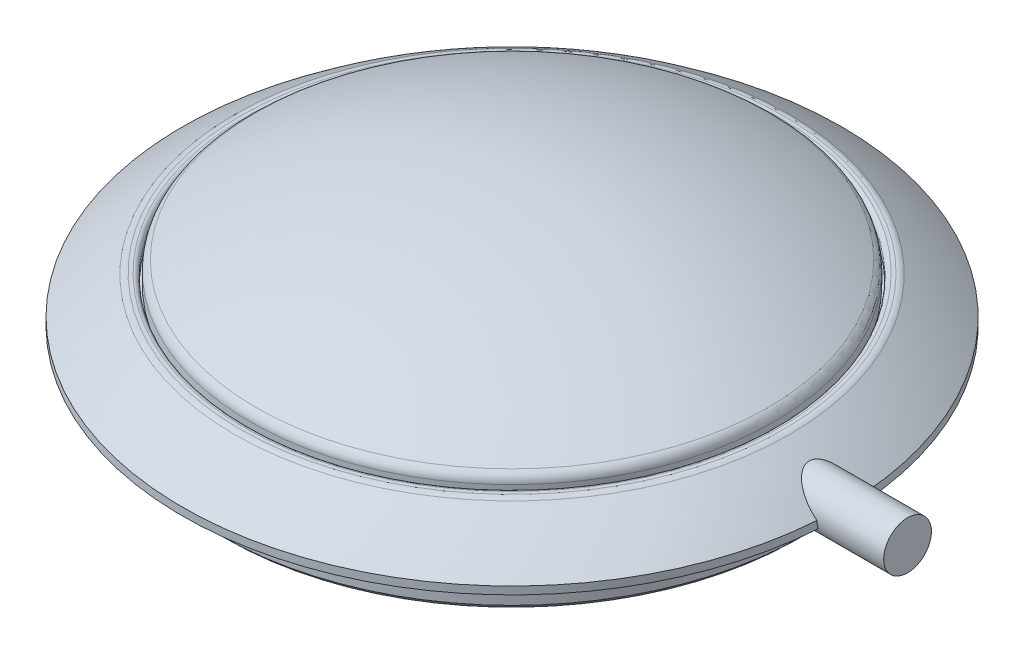
ISO-10303-21;
HEADER;
FILE_DESCRIPTION(('STEP AP214'),'2;1');
FILE_NAME('part.step','',(''),(''),'','','');
FILE_SCHEMA(('AUTOMOTIVE_DESIGN { 1 0 10303 214 1 1 1 1 }'));
ENDSEC;
DATA;
#1=APPLICATION_CONTEXT('core data for automotive mechanical design processes');
#2=APPLICATION_PROTOCOL_DEFINITION('international standard','automotive_design',2000,#1);
#3=PRODUCT_CONTEXT('',#1,'mechanical');
#4=PRODUCT('Part','Part','',(#3));
#5=PRODUCT_RELATED_PRODUCT_CATEGORY('part','',(#4));
#6=PRODUCT_DEFINITION_FORMATION('','',#4);
#7=PRODUCT_DEFINITION_CONTEXT('part definition',#1,'design');
#8=PRODUCT_DEFINITION('design','',#6,#7);
#9=PRODUCT_DEFINITION_SHAPE('','',#8);
#10=(LENGTH_UNIT() NAMED_UNIT(*) SI_UNIT(.MILLI.,.METRE.));
#11=(NAMED_UNIT(*) PLANE_ANGLE_UNIT() SI_UNIT($,.RADIAN.));
#12=(NAMED_UNIT(*) SI_UNIT($,.STERADIAN.) SOLID_ANGLE_UNIT());
#13=UNCERTAINTY_MEASURE_WITH_UNIT(LENGTH_MEASURE(1.E-05),#10,'distance_accuracy_value','');
#14=(GEOMETRIC_REPRESENTATION_CONTEXT(3) GLOBAL_UNCERTAINTY_ASSIGNED_CONTEXT((#13)) GLOBAL_UNIT_ASSIGNED_CONTEXT((#10,
#11,#12)) REPRESENTATION_CONTEXT('',''));
#15=CARTESIAN_POINT('',(0.,0.,0.));
#16=DIRECTION('',(0.,0.,1.));
#17=DIRECTION('',(1.,0.,0.));
#18=AXIS2_PLACEMENT_3D('',#15,#16,#17);
#19=CARTESIAN_POINT('',(0.,15.,0.));
#20=DIRECTION('',(0.,-1.,0.));
#21=DIRECTION('',(0.,0.,-1.));
#22=AXIS2_PLACEMENT_3D('',#19,#20,#21);
#23=CYLINDRICAL_SURFACE('',#22,30.);
#24=CARTESIAN_POINT('',(29.9210523711984,4.5,2.175));
#25=CARTESIAN_POINT('',(29.9210507722902,4.44040425495209,2.17500557248523));
#26=CARTESIAN_POINT('',(29.9212304240732,4.38080951030615,2.17255060085139));
#27=CARTESIAN_POINT('',(29.9219378031227,4.26242174033899,2.16279440265997));
#28=CARTESIAN_POINT('',(29.9224631930128,4.20362601873529,2.15552571732212));
#29=CARTESIAN_POINT('',(29.9238479367281,4.08682776167588,2.13621567310057));
#30=CARTESIAN_POINT('',(29.9247072901133,4.02882522517506,2.12417432050601));
#31=CARTESIAN_POINT('',(29.9267416387054,3.91361186554651,2.09531154058866));
#32=CARTESIAN_POINT('',(29.9279187214244,3.8564090089525,2.07845845586816));
#33=CARTESIAN_POINT('',(29.9292394657799,3.8,2.05927778602111));
#34=B_SPLINE_CURVE_WITH_KNOTS('',3,(#24,#25,#26,#27,#28,#29,#30,#31,#32,#33),.UNSPECIFIED.,.F.,
.F.,(4,2,2,2,4),(0.,0.178734835087422,0.356273571488974,0.533812073941133,0.712546674705668),.UNSPECIFIED.);
#35=CARTESIAN_POINT('',(29.9210523711984,4.5,2.175));
#36=VERTEX_POINT('',#35);
#37=CARTESIAN_POINT('',(29.92923946578,3.8,2.05927778602111));
#38=VERTEX_POINT('',#37);
#39=EDGE_CURVE('E114',#36,#38,#34,.T.);
#40=ORIENTED_EDGE('',*,*,#39,.F.);
#41=CARTESIAN_POINT('',(0.,4.5,0.));
#42=DIRECTION('',(0.,-1.,0.));
#43=DIRECTION('',(0.,0.,-1.));
#44=AXIS2_PLACEMENT_3D('',#41,#42,#43);
#45=CIRCLE('',#44,30.);
#46=CARTESIAN_POINT('',(29.9210523711984,4.5,-2.175));
#47=VERTEX_POINT('',#46);
#48=EDGE_CURVE('E124',#36,#47,#45,.T.);
#49=ORIENTED_EDGE('',*,*,#48,.T.);
#50=CARTESIAN_POINT('',(29.92923946578,3.8,-2.05927778602111));
#51=CARTESIAN_POINT('',(29.9279187214244,3.85640900895251,-2.07845845586816));
#52=CARTESIAN_POINT('',(29.9267416387054,3.91361186554651,-2.09531154058866));
#53=CARTESIAN_POINT('',(29.9247072901133,4.02882522517506,-2.12417432050601));
#54=CARTESIAN_POINT('',(29.9238479367281,4.08682776167588,-2.13621567310057));
#55=CARTESIAN_POINT('',(29.9224631930128,4.20362601873529,-2.15552571732212));
#56=CARTESIAN_POINT('',(29.9219378031227,4.26242174033899,-2.16279440265997));
#57=CARTESIAN_POINT('',(29.9212304240732,4.38080951030615,-2.17255060085139));
#58=CARTESIAN_POINT('',(29.9210507722902,4.44040425495209,-2.17500557248523));
#59=CARTESIAN_POINT('',(29.9210523711984,4.5,-2.175));
#60=B_SPLINE_CURVE_WITH_KNOTS('',3,(#50,#51,#52,#53,#54,#55,#56,#57,#58,#59),.UNSPECIFIED.,.F.,
.F.,(4,2,2,2,4),(0.,0.178734600764535,0.356273103216694,0.533811839618246,0.712546674705668),.UNSPECIFIED.);
#61=CARTESIAN_POINT('',(29.92923946578,3.8,-2.05927778602111));
#62=VERTEX_POINT('',#61);
#63=EDGE_CURVE('E82',#62,#47,#60,.T.);
#64=ORIENTED_EDGE('',*,*,#63,.F.);
#65=CARTESIAN_POINT('',(0.,3.8,0.));
#66=DIRECTION('',(0.,1.,0.));
#67=DIRECTION('',(0.,0.,1.));
#68=AXIS2_PLACEMENT_3D('',#65,#66,#67);
#69=CIRCLE('',#68,30.);
#70=EDGE_CURVE('E120',#62,#38,#69,.T.);
#71=ORIENTED_EDGE('',*,*,#70,.T.);
#72=EDGE_LOOP('',(#40,#49,#64,#71));
#73=FACE_BOUND('',#72,.T.);
#74=ADVANCED_FACE('F67',(#73),#23,.T.);
#75=CARTESIAN_POINT('',(0.,3.8,0.));
#76=DIRECTION('',(0.,1.,0.));
#77=DIRECTION('',(0.,0.,1.));
#78=AXIS2_PLACEMENT_3D('',#75,#76,#77);
#79=PLANE('',#78);
#80=DIRECTION('',(-1.,0.,0.));
#81=VECTOR('',#80,1.);
#82=CARTESIAN_POINT('',(36.,3.8,-2.05927778602111));
#83=LINE('',#82,#81);
#84=CARTESIAN_POINT('',(27.4227893366083,3.8,-2.05927778602111));
#85=VERTEX_POINT('',#84);
#86=EDGE_CURVE('E299',#85,#62,#83,.F.);
#87=ORIENTED_EDGE('',*,*,#86,.F.);
#88=CARTESIAN_POINT('',(0.,3.8,0.));
#89=DIRECTION('',(0.,1.,0.));
#90=DIRECTION('',(0.,0.,1.));
#91=AXIS2_PLACEMENT_3D('',#88,#89,#90);
#92=CIRCLE('',#91,27.5);
#93=CARTESIAN_POINT('',(27.4227893366083,3.8,2.05927778602111));
#94=VERTEX_POINT('',#93);
#95=EDGE_CURVE('E140',#85,#94,#92,.T.);
#96=ORIENTED_EDGE('',*,*,#95,.T.);
#97=DIRECTION('',(-1.,0.,0.));
#98=VECTOR('',#97,1.);
#99=CARTESIAN_POINT('',(36.,3.8,2.05927778602111));
#100=LINE('',#99,#98);
#101=EDGE_CURVE('E126',#38,#94,#100,.T.);
#102=ORIENTED_EDGE('',*,*,#101,.F.);
#103=ORIENTED_EDGE('',*,*,#70,.F.);
#104=EDGE_LOOP('',(#87,#96,#102,#103));
#105=FACE_BOUND('',#104,.T.);
#106=ADVANCED_FACE('F197',(#105),#79,.F.);
#107=CARTESIAN_POINT('',(0.,3.8,0.));
#108=DIRECTION('',(0.,-1.,0.));
#109=DIRECTION('',(0.,0.,-1.));
#110=AXIS2_PLACEMENT_3D('',#107,#108,#109);
#111=CYLINDRICAL_SURFACE('',#110,27.5);
#112=CARTESIAN_POINT('',(27.4227893366083,3.8,2.05927778602111));
#113=CARTESIAN_POINT('',(27.4239161252362,3.75583828138245,2.04426828444051));
#114=CARTESIAN_POINT('',(27.4251380844221,3.7121633113989,2.02783521702575));
#115=CARTESIAN_POINT('',(27.4277445556678,3.62614056304129,1.99227249811847));
#116=CARTESIAN_POINT('',(27.4291283794124,3.58378807001969,1.97315420030913));
#117=CARTESIAN_POINT('',(27.4320404166582,3.50039835059532,1.93224697358378));
#118=CARTESIAN_POINT('',(27.4335686299862,3.45936112261433,1.91045804787252));
#119=CARTESIAN_POINT('',(27.4367503508111,3.37860161561401,1.86420682910092));
#120=CARTESIAN_POINT('',(27.438404349089,3.33888545824047,1.83973388034803));
#121=CARTESIAN_POINT('',(27.4401052293901,3.3,1.81400799336717));
#122=B_SPLINE_CURVE_WITH_KNOTS('',3,(#112,#113,#114,#115,#116,#117,#118,#119,#120,#121),
.UNSPECIFIED.,.F.,.F.,(4,2,2,2,4),(0.,0.139944074089579,0.279313317385029,0.418682393439945,
0.558626300112478),.UNSPECIFIED.);
#123=CARTESIAN_POINT('',(27.4401052293901,3.3,1.81400799336717));
#124=VERTEX_POINT('',#123);
#125=EDGE_CURVE('E184',#94,#124,#122,.T.);
#126=ORIENTED_EDGE('',*,*,#125,.F.);
#127=ORIENTED_EDGE('',*,*,#95,.F.);
#128=CARTESIAN_POINT('',(27.4401052293901,3.3,-1.81400799336717));
#129=CARTESIAN_POINT('',(27.438404349089,3.33888545824047,-1.83973388034803));
#130=CARTESIAN_POINT('',(27.4367503508111,3.37860161561401,-1.86420682910092));
#131=CARTESIAN_POINT('',(27.4335686299862,3.45936112261433,-1.91045804787252));
#132=CARTESIAN_POINT('',(27.4320404166582,3.50039835059532,-1.93224697358378));
#133=CARTESIAN_POINT('',(27.4291283794124,3.58378807001969,-1.97315420030913));
#134=CARTESIAN_POINT('',(27.4277445556678,3.62614056304129,-1.99227249811847));
#135=CARTESIAN_POINT('',(27.4251380844221,3.7121633113989,-2.02783521702575));
#136=CARTESIAN_POINT('',(27.4239161252362,3.75583828138245,-2.04426828444051));
#137=CARTESIAN_POINT('',(27.4227893366083,3.8,-2.05927778602111));
#138=B_SPLINE_CURVE_WITH_KNOTS('',3,(#128,#129,#130,#131,#132,#133,#134,#135,#136,#137),
.UNSPECIFIED.,.F.,.F.,(4,2,2,2,4),(0.,0.139943906672533,0.279312982727449,0.4186822260229,
0.558626300112478),.UNSPECIFIED.);
#139=CARTESIAN_POINT('',(27.4401052293901,3.3,-1.81400799336717));
#140=VERTEX_POINT('',#139);
#141=EDGE_CURVE('E177',#140,#85,#138,.T.);
#142=ORIENTED_EDGE('',*,*,#141,.F.);
#143=CARTESIAN_POINT('',(0.,3.3,0.));
#144=DIRECTION('',(0.,1.,0.));
#145=DIRECTION('',(0.,0.,1.));
#146=AXIS2_PLACEMENT_3D('',#143,#144,#145);
#147=CIRCLE('',#146,27.5);
#148=EDGE_CURVE('E133',#140,#124,#147,.T.);
#149=ORIENTED_EDGE('',*,*,#148,.T.);
#150=EDGE_LOOP('',(#126,#127,#142,#149));
#151=FACE_BOUND('',#150,.T.);
#152=ADVANCED_FACE('F191',(#151),#111,.T.);
#153=CARTESIAN_POINT('',(0.,3.3,0.));
#154=DIRECTION('',(0.,1.,0.));
#155=DIRECTION('',(0.,0.,1.));
#156=AXIS2_PLACEMENT_3D('',#153,#154,#155);
#157=PLANE('',#156);
#158=DIRECTION('',(-1.,0.,0.));
#159=VECTOR('',#158,1.);
#160=CARTESIAN_POINT('',(36.,3.3,-1.81400799336717));
#161=LINE('',#160,#159);
#162=CARTESIAN_POINT('',(26.4378398323312,3.3,-1.81400799336717));
#163=VERTEX_POINT('',#162);
#164=EDGE_CURVE('E265',#163,#140,#161,.F.);
#165=ORIENTED_EDGE('',*,*,#164,.F.);
#166=CARTESIAN_POINT('',(0.,3.3,0.));
#167=DIRECTION('',(0.,1.,0.));
#168=DIRECTION('',(0.,0.,1.));
#169=AXIS2_PLACEMENT_3D('',#166,#167,#168);
#170=CIRCLE('',#169,26.5);
#171=CARTESIAN_POINT('',(26.4378398323312,3.3,1.81400799336717));
#172=VERTEX_POINT('',#171);
#173=EDGE_CURVE('E129',#163,#172,#170,.T.);
#174=ORIENTED_EDGE('',*,*,#173,.T.);
#175=DIRECTION('',(-1.,0.,0.));
#176=VECTOR('',#175,1.);
#177=CARTESIAN_POINT('',(36.,3.3,1.81400799336717));
#178=LINE('',#177,#176);
#179=EDGE_CURVE('E189',#124,#172,#178,.T.);
#180=ORIENTED_EDGE('',*,*,#179,.F.);
#181=ORIENTED_EDGE('',*,*,#148,.F.);
#182=EDGE_LOOP('',(#165,#174,#180,#181));
#183=FACE_BOUND('',#182,.T.);
#184=ADVANCED_FACE('F196',(#183),#157,.F.);
#185=CARTESIAN_POINT('',(0.,3.3,0.));
#186=DIRECTION('',(0.,-1.,0.));
#187=DIRECTION('',(0.,0.,-1.));
#188=AXIS2_PLACEMENT_3D('',#185,#186,#187);
#189=CYLINDRICAL_SURFACE('',#188,26.5);
#190=CARTESIAN_POINT('',(0.,0.500000000000007,0.));
#191=DIRECTION('',(0.,1.,0.));
#192=DIRECTION('',(0.,0.,1.));
#193=AXIS2_PLACEMENT_3D('',#190,#191,#192);
#194=CIRCLE('',#193,26.5);
#195=CARTESIAN_POINT('',(0.,0.500000000000007,26.5));
#196=VERTEX_POINT('',#195);
#197=EDGE_CURVE('E119',#196,#196,#194,.T.);
#198=ORIENTED_EDGE('',*,*,#197,.T.);
#199=EDGE_LOOP('',(#198));
#200=FACE_BOUND('',#199,.T.);
#201=CARTESIAN_POINT('',(26.4378398323312,3.3,1.81400799336717));
#202=CARTESIAN_POINT('',(26.4401571000158,3.24893763478484,1.78022867010242));
#203=CARTESIAN_POINT('',(26.4425569249394,3.19932910952958,1.7443108591682));
#204=CARTESIAN_POINT('',(26.4474535463998,3.10331891973786,1.66842885337983));
#205=CARTESIAN_POINT('',(26.4499503382451,3.05691710035103,1.62846485414437));
#206=CARTESIAN_POINT('',(26.4574768798844,2.92309536870965,1.50296813598129));
#207=CARTESIAN_POINT('',(26.4625500565354,2.8409063216402,1.4117293547589));
#208=CARTESIAN_POINT('',(26.4722324935605,2.69301467521226,1.21672957903897));
#209=CARTESIAN_POINT('',(26.4768415338913,2.62731987380775,1.11296269585466));
#210=CARTESIAN_POINT('',(26.4850757309654,2.51428923108145,0.895847824353795));
#211=CARTESIAN_POINT('',(26.4887011305246,2.46694885764793,0.782502209666496));
#212=CARTESIAN_POINT('',(26.4945562281915,2.39202949149202,0.549578756972597));
#213=CARTESIAN_POINT('',(26.4967876160912,2.36442656754835,0.430008655469356));
#214=CARTESIAN_POINT('',(26.4996104079275,2.32968171042448,0.187888162837732));
#215=CARTESIAN_POINT('',(26.5002015168659,2.32254345773444,0.0653372396166261));
#216=CARTESIAN_POINT('',(26.4996769010041,2.32893813744245,-0.178861701445099));
#217=CARTESIAN_POINT('',(26.4985661328941,2.3424110399991,-0.300511308387864));
#218=CARTESIAN_POINT('',(26.4947719409747,2.38952379965176,-0.53979803196447));
#219=CARTESIAN_POINT('',(26.4920887328104,2.423160891436,-0.657435696457509));
#220=CARTESIAN_POINT('',(26.4854499578581,2.50964035329496,-0.885416949579747));
#221=CARTESIAN_POINT('',(26.481494046685,2.5624879221013,-0.995758554189695));
#222=CARTESIAN_POINT('',(26.47275164673,2.68589417514891,-1.20602779146514));
#223=CARTESIAN_POINT('',(26.4679651828547,2.75645232831403,-1.30595573627137));
#224=CARTESIAN_POINT('',(26.4588124214033,2.90192769555066,-1.47907328627082));
#225=CARTESIAN_POINT('',(26.4544851686266,2.97474647693113,-1.55404046621584));
#226=CARTESIAN_POINT('',(26.4459705897753,3.1303063045741,-1.69277036127136));
#227=CARTESIAN_POINT('',(26.4417831898548,3.21304200504405,-1.75653906770989));
#228=CARTESIAN_POINT('',(26.4378398323312,3.3,-1.81400799336717));
#229=B_SPLINE_CURVE_WITH_KNOTS('',3,(#201,#202,#203,#204,#205,#206,#207,#208,#209,#210,#211,
#212,#213,#214,#215,#216,#217,#218,#219,#220,#221,#222,#223,#224,#225,#226,#227,#228),
.UNSPECIFIED.,.F.,.F.,(4,2,2,2,2,2,2,2,2,2,2,2,2,4),(0.,0.183691053921572,0.367373231277329,
0.734193948532478,1.10118776176677,1.46809089836099,1.8345484151854,2.20107183381117,
2.56652978610665,2.9319376310537,3.29744443623354,3.66294028249987,3.97569177008202,
4.28827541839682),.UNSPECIFIED.);
#230=EDGE_CURVE('E261',#172,#163,#229,.T.);
#231=ORIENTED_EDGE('',*,*,#230,.F.);
#232=ORIENTED_EDGE('',*,*,#173,.F.);
#233=EDGE_LOOP('',(#231,#232));
#234=FACE_BOUND('',#233,.T.);
#235=ADVANCED_FACE('F257',(#200,#234),#189,.T.);
#236=CARTESIAN_POINT('',(0.,-33.107142857143,0.));
#237=DIRECTION('',(0.,-1.,0.));
#238=DIRECTION('',(-1.,0.,0.));
#239=AXIS2_PLACEMENT_3D('',#236,#237,#238);
#240=SPHERICAL_SURFACE('',#239,48.107142857143);
#241=CARTESIAN_POINT('',(0.,7.84519134720959,0.));
#242=DIRECTION('',(0.,-1.,0.));
#243=DIRECTION('',(0.,0.,-1.));
#244=AXIS2_PLACEMENT_3D('',#241,#242,#243);
#245=CIRCLE('',#244,25.2428904266642);
#246=CARTESIAN_POINT('',(0.,7.84519134720959,-25.2428904266642));
#247=VERTEX_POINT('',#246);
#248=EDGE_CURVE('E232',#247,#247,#245,.T.);
#249=ORIENTED_EDGE('',*,*,#248,.T.);
#250=EDGE_LOOP('',(#249));
#251=FACE_BOUND('',#250,.T.);
#252=ORIENTED_EDGE('',*,*,#48,.F.);
#253=CARTESIAN_POINT('',(29.9213037459457,4.4998,2.1749999908046));
#254=CARTESIAN_POINT('',(29.860354409551,4.54829320853694,2.17500101073915));
#255=CARTESIAN_POINT('',(29.7993402127421,4.59668941116069,2.17338739780968));
#256=CARTESIAN_POINT('',(29.6772704406083,4.69321751794534,2.16694138842662));
#257=CARTESIAN_POINT('',(29.6162148643579,4.74134941595931,2.16210891742911));
#258=CARTESIAN_POINT('',(29.4328962224406,4.88541794087907,2.14277515477485));
#259=CARTESIAN_POINT('',(29.3107082196935,4.98084680733808,2.12343756567662));
#260=CARTESIAN_POINT('',(29.0661264076119,5.17068098470287,2.0713788812293));
#261=CARTESIAN_POINT('',(28.9437457301755,5.26506272433349,2.03850975642602));
#262=CARTESIAN_POINT('',(28.7014353048051,5.45077224635833,1.95879062723407));
#263=CARTESIAN_POINT('',(28.5815031137465,5.542103137305,1.91195536829822));
#264=CARTESIAN_POINT('',(28.3370549396025,5.727115456864,1.79927139599704));
#265=CARTESIAN_POINT('',(28.2128153882553,5.82050567619035,1.73231151079199));
#266=CARTESIAN_POINT('',(28.0321707853541,5.95544717066019,1.61733367964668));
#267=CARTESIAN_POINT('',(27.9729615452683,5.99953119066519,1.57662996796225));
#268=CARTESIAN_POINT('',(27.8569418112767,6.08564994744236,1.48998988873699));
#269=CARTESIAN_POINT('',(27.8001306972233,6.12768521445557,1.44405488549472));
#270=CARTESIAN_POINT('',(27.6632603497254,6.2286614233344,1.32332012683041));
#271=CARTESIAN_POINT('',(27.5849967277748,6.28613301775396,1.24518354635422));
#272=CARTESIAN_POINT('',(27.4385223242699,6.39328669582687,1.0752411284962));
#273=CARTESIAN_POINT('',(27.3702943623947,6.44298210128511,0.983459205763183));
#274=CARTESIAN_POINT('',(27.2673376366543,6.51774811614942,0.815484517155771));
#275=CARTESIAN_POINT('',(27.2287217128449,6.54571814374497,0.742990335232145));
#276=CARTESIAN_POINT('',(27.1611674942129,6.59456881189191,0.591372431429883));
#277=CARTESIAN_POINT('',(27.1322157650086,6.61545929447521,0.512258105429106));
#278=CARTESIAN_POINT('',(27.0897889753825,6.64604305897315,0.360809830208454));
#279=CARTESIAN_POINT('',(27.0746660712701,6.65692973928714,0.289184948652009));
#280=CARTESIAN_POINT('',(27.0544671981202,6.67146629247286,0.143813675632987));
#281=CARTESIAN_POINT('',(27.0493845589975,6.67512096980992,0.0700687256674828));
#282=CARTESIAN_POINT('',(27.0497296583231,6.67487274938097,-0.0774611809869981));
#283=CARTESIAN_POINT('',(27.0551684190373,6.67096192596236,-0.15124609858896));
#284=CARTESIAN_POINT('',(27.0760681139207,6.65592042989793,-0.29662564397149));
#285=CARTESIAN_POINT('',(27.0915361271205,6.64478465760272,-0.368218687235695));
#286=CARTESIAN_POINT('',(27.1357864882382,6.61288390579251,-0.523420023785068));
#287=CARTESIAN_POINT('',(27.1667979186022,6.59050416392385,-0.606054308969611));
#288=CARTESIAN_POINT('',(27.2392257070044,6.53811373993336,-0.763987410128501));
#289=CARTESIAN_POINT('',(27.2806597193854,6.50809010911517,-0.839273475881303));
#290=CARTESIAN_POINT('',(27.3922098293659,6.42703498156613,-1.01507599068411));
#291=CARTESIAN_POINT('',(27.466744703681,6.37269815550825,-1.11123275329663));
#292=CARTESIAN_POINT('',(27.6265352853494,6.25565512219816,-1.28825732774018));
#293=CARTESIAN_POINT('',(27.7118140692596,6.19293088148876,-1.36909126298254));
#294=CARTESIAN_POINT('',(27.8723596261126,6.07425039683469,-1.50291022502454));
#295=CARTESIAN_POINT('',(27.9464259715694,6.01929097810602,-1.55826526644343));
#296=CARTESIAN_POINT('',(28.0979107869339,5.90641530980611,-1.66085615470386));
#297=CARTESIAN_POINT('',(28.1753312747706,5.84849727640427,-1.70808702649916));
#298=CARTESIAN_POINT('',(28.3327910443669,5.7301990999166,-1.79517217474891));
#299=CARTESIAN_POINT('',(28.4128372182507,5.66981235403557,-1.83500484247064));
#300=CARTESIAN_POINT('',(28.5746860883655,5.54718461812118,-1.90764454341597));
#301=CARTESIAN_POINT('',(28.6564891569834,5.48494323387845,-1.94045007068796));
#302=CARTESIAN_POINT('',(28.8361666153164,5.34763583099867,-2.00471293971274));
#303=CARTESIAN_POINT('',(28.9342842350005,5.27227741770302,-2.03486550743554));
#304=CARTESIAN_POINT('',(29.1316038502371,5.11994574122822,-2.08632542194493));
#305=CARTESIAN_POINT('',(29.2308061318557,5.04297204686567,-2.10763037456576));
#306=CARTESIAN_POINT('',(29.4285941388551,4.8887144018224,-2.14142375886964));
#307=CARTESIAN_POINT('',(29.5271738141543,4.81144422506462,-2.15401086777727));
#308=CARTESIAN_POINT('',(29.7243346386744,4.65612816160523,-2.17078694338801));
#309=CARTESIAN_POINT('',(29.8229157463872,4.57808280428474,-2.17498129198194));
#310=CARTESIAN_POINT('',(29.9213037459457,4.4998,-2.1749999908046));
#311=B_SPLINE_CURVE_WITH_KNOTS('',3,(#253,#254,#255,#256,#257,#258,#259,#260,#261,#262,#263,
#264,#265,#266,#267,#268,#269,#270,#271,#272,#273,#274,#275,#276,#277,#278,#279,#280,#281,#282,
#283,#284,#285,#286,#287,#288,#289,#290,#291,#292,#293,#294,#295,#296,#297,#298,#299,#300,#301,
#302,#303,#304,#305,#306,#307,#308,#309,#310),.UNSPECIFIED.,.F.,.F.,(4,2,2,2,2,2,2,2,2,2,2,2,2,
2,2,2,2,2,2,2,2,2,2,2,2,2,2,2,4),(0.,0.233625579629342,0.467256569863057,0.935386018580349,
1.4087787574007,1.88167344692752,2.3880409671344,2.64074835732213,2.89338999277296,
3.26620445318572,3.63837306256082,3.89781464562088,4.15689405725905,4.37794857873781,
4.59885619681841,4.81999536404154,5.04129078993305,5.31295341358565,5.58507932995242,
5.98259998612774,6.38098950726848,6.7032572191696,7.0257215828668,7.34911347972502,
7.67257461191245,8.05423911708017,8.43600683352044,8.81337941538836,9.19050992794065),.UNSPECIFIED.);
#312=EDGE_CURVE('E111',#36,#47,#311,.T.);
#313=ORIENTED_EDGE('',*,*,#312,.T.);
#314=EDGE_LOOP('',(#252,#313));
#315=FACE_BOUND('',#314,.T.);
#316=ADVANCED_FACE('F128',(#251,#315),#240,.T.);
#317=CARTESIAN_POINT('',(0.,0.,0.));
#318=DIRECTION('',(0.,1.,0.));
#319=DIRECTION('',(0.,0.,1.));
#320=AXIS2_PLACEMENT_3D('',#317,#318,#319);
#321=PLANE('',#320);
#322=CARTESIAN_POINT('',(0.,0.,0.));
#323=DIRECTION('',(0.,1.,0.));
#324=DIRECTION('',(0.,0.,1.));
#325=AXIS2_PLACEMENT_3D('',#322,#323,#324);
#326=CIRCLE('',#325,26.);
#327=CARTESIAN_POINT('',(0.,0.,26.));
#328=VERTEX_POINT('',#327);
#329=EDGE_CURVE('E282',#328,#328,#326,.F.);
#330=ORIENTED_EDGE('',*,*,#329,.T.);
#331=EDGE_LOOP('',(#330));
#332=FACE_BOUND('',#331,.T.);
#333=ADVANCED_FACE('F204',(#332),#321,.F.);
#334=CARTESIAN_POINT('',(0.,7.99391788193722,0.));
#335=DIRECTION('',(0.,1.,0.));
#336=DIRECTION('',(0.,0.,1.));
#337=AXIS2_PLACEMENT_3D('',#334,#335,#336);
#338=PLANE('',#337);
#339=CARTESIAN_POINT('',(0.,7.99391788193722,0.));
#340=DIRECTION('',(0.,1.,0.));
#341=DIRECTION('',(0.,0.,1.));
#342=AXIS2_PLACEMENT_3D('',#339,#340,#341);
#343=CIRCLE('',#342,24.4);
#344=CARTESIAN_POINT('',(0.,7.99391788193722,24.4));
#345=VERTEX_POINT('',#344);
#346=EDGE_CURVE('E75',#345,#345,#343,.F.);
#347=ORIENTED_EDGE('',*,*,#346,.T.);
#348=EDGE_LOOP('',(#347));
#349=FACE_BOUND('',#348,.T.);
#350=CARTESIAN_POINT('',(0.,7.99391788193722,0.));
#351=DIRECTION('',(0.,1.,0.));
#352=DIRECTION('',(0.,0.,1.));
#353=AXIS2_PLACEMENT_3D('',#350,#351,#352);
#354=CIRCLE('',#353,24.7181681312324);
#355=CARTESIAN_POINT('',(0.,7.99391788193722,24.7181681312324));
#356=VERTEX_POINT('',#355);
#357=EDGE_CURVE('E229',#356,#356,#354,.T.);
#358=ORIENTED_EDGE('',*,*,#357,.T.);
#359=EDGE_LOOP('',(#358));
#360=FACE_BOUND('',#359,.T.);
#361=ADVANCED_FACE('F206',(#349,#360),#338,.T.);
#362=CARTESIAN_POINT('',(0.,0.,0.));
#363=DIRECTION('',(0.,-1.,0.));
#364=DIRECTION('',(0.,0.,-1.));
#365=AXIS2_PLACEMENT_3D('',#362,#363,#364);
#366=CYLINDRICAL_SURFACE('',#365,24.);
#367=CARTESIAN_POINT('',(0.,7.59391788193722,0.));
#368=DIRECTION('',(0.,1.,0.));
#369=DIRECTION('',(0.,0.,1.));
#370=AXIS2_PLACEMENT_3D('',#367,#368,#369);
#371=CIRCLE('',#370,24.);
#372=CARTESIAN_POINT('',(0.,7.59391788193722,24.));
#373=VERTEX_POINT('',#372);
#374=EDGE_CURVE('E13',#373,#373,#371,.T.);
#375=ORIENTED_EDGE('',*,*,#374,.T.);
#376=EDGE_LOOP('',(#375));
#377=FACE_BOUND('',#376,.T.);
#378=CARTESIAN_POINT('',(0.,6.99391788193722,0.));
#379=DIRECTION('',(0.,-1.,0.));
#380=DIRECTION('',(0.,0.,-1.));
#381=AXIS2_PLACEMENT_3D('',#378,#379,#380);
#382=CIRCLE('',#381,24.);
#383=CARTESIAN_POINT('',(0.,6.99391788193722,-24.));
#384=VERTEX_POINT('',#383);
#385=EDGE_CURVE('E130',#384,#384,#382,.T.);
#386=ORIENTED_EDGE('',*,*,#385,.T.);
#387=EDGE_LOOP('',(#386));
#388=FACE_BOUND('',#387,.T.);
#389=ADVANCED_FACE('F247',(#377,#388),#366,.F.);
#390=CARTESIAN_POINT('',(0.,6.99391788193722,0.));
#391=DIRECTION('',(0.,1.,0.));
#392=DIRECTION('',(0.,0.,1.));
#393=AXIS2_PLACEMENT_3D('',#390,#391,#392);
#394=PLANE('',#393);
#395=CARTESIAN_POINT('',(0.,6.99391788193722,0.));
#396=DIRECTION('',(0.,-1.,0.));
#397=DIRECTION('',(0.,0.,-1.));
#398=AXIS2_PLACEMENT_3D('',#395,#396,#397);
#399=CIRCLE('',#398,23.8);
#400=CARTESIAN_POINT('',(0.,6.99391788193722,-23.8));
#401=VERTEX_POINT('',#400);
#402=EDGE_CURVE('E136',#401,#401,#399,.T.);
#403=ORIENTED_EDGE('',*,*,#402,.T.);
#404=EDGE_LOOP('',(#403));
#405=FACE_BOUND('',#404,.T.);
#406=ORIENTED_EDGE('',*,*,#385,.F.);
#407=EDGE_LOOP('',(#406));
#408=FACE_BOUND('',#407,.T.);
#409=ADVANCED_FACE('F253',(#405,#408),#394,.T.);
#410=CARTESIAN_POINT('',(0.,0.,0.));
#411=DIRECTION('',(0.,-1.,0.));
#412=DIRECTION('',(0.,0.,-1.));
#413=AXIS2_PLACEMENT_3D('',#410,#411,#412);
#414=CYLINDRICAL_SURFACE('',#413,23.8);
#415=CARTESIAN_POINT('',(0.,8.11473128951942,0.));
#416=DIRECTION('',(0.,-1.,0.));
#417=DIRECTION('',(0.,0.,-1.));
#418=AXIS2_PLACEMENT_3D('',#415,#416,#417);
#419=CIRCLE('',#418,23.8);
#420=CARTESIAN_POINT('',(0.,8.11473128951942,-23.8));
#421=VERTEX_POINT('',#420);
#422=EDGE_CURVE('E238',#421,#421,#419,.T.);
#423=ORIENTED_EDGE('',*,*,#422,.T.);
#424=EDGE_LOOP('',(#423));
#425=FACE_BOUND('',#424,.T.);
#426=ORIENTED_EDGE('',*,*,#402,.F.);
#427=EDGE_LOOP('',(#426));
#428=FACE_BOUND('',#427,.T.);
#429=ADVANCED_FACE('F271',(#425,#428),#414,.T.);
#430=CARTESIAN_POINT('',(0.,8.98979760953955,0.));
#431=DIRECTION('',(0.,-1.,0.));
#432=DIRECTION('',(0.,0.,-1.));
#433=AXIS2_PLACEMENT_3D('',#430,#431,#432);
#434=CIRCLE('',#433,23.2840030326005);
#435=CARTESIAN_POINT('',(0.,8.98979760953955,-23.2840030326005));
#436=VERTEX_POINT('',#435);
#437=EDGE_CURVE('E234',#436,#436,#434,.F.);
#438=ORIENTED_EDGE('',*,*,#437,.T.);
#439=EDGE_LOOP('',(#438));
#440=FACE_BOUND('',#439,.T.);
#441=CARTESIAN_POINT('',(0.,15.,0.));
#442=VERTEX_POINT('',#441);
#443=VERTEX_LOOP('',#442);
#444=FACE_BOUND('',#443,.T.);
#445=ADVANCED_FACE('F152',(#440,#444),#240,.T.);
#446=CARTESIAN_POINT('',(36.,4.5,0.));
#447=DIRECTION('',(-1.,0.,0.));
#448=DIRECTION('',(0.,0.,1.));
#449=AXIS2_PLACEMENT_3D('',#446,#447,#448);
#450=CYLINDRICAL_SURFACE('',#449,2.175);
#451=CARTESIAN_POINT('',(36.,4.5,0.));
#452=DIRECTION('',(1.,0.,0.));
#453=DIRECTION('',(0.,0.,-1.));
#454=AXIS2_PLACEMENT_3D('',#451,#452,#453);
#455=CIRCLE('',#454,2.175);
#456=CARTESIAN_POINT('',(36.,4.5,-2.175));
#457=VERTEX_POINT('',#456);
#458=EDGE_CURVE('E300',#457,#457,#455,.T.);
#459=ORIENTED_EDGE('',*,*,#458,.F.);
#460=EDGE_LOOP('',(#459));
#461=FACE_BOUND('',#460,.T.);
#462=ORIENTED_EDGE('',*,*,#179,.T.);
#463=ORIENTED_EDGE('',*,*,#230,.T.);
#464=ORIENTED_EDGE('',*,*,#164,.T.);
#465=ORIENTED_EDGE('',*,*,#141,.T.);
#466=ORIENTED_EDGE('',*,*,#86,.T.);
#467=ORIENTED_EDGE('',*,*,#63,.T.);
#468=ORIENTED_EDGE('',*,*,#312,.F.);
#469=ORIENTED_EDGE('',*,*,#39,.T.);
#470=ORIENTED_EDGE('',*,*,#101,.T.);
#471=ORIENTED_EDGE('',*,*,#125,.T.);
#472=EDGE_LOOP('',(#462,#463,#464,#465,#466,#467,#468,#469,#470,#471));
#473=FACE_BOUND('',#472,.T.);
#474=ADVANCED_FACE('F113',(#461,#473),#450,.T.);
#475=CARTESIAN_POINT('',(36.,0.,0.));
#476=DIRECTION('',(1.,0.,0.));
#477=DIRECTION('',(0.,0.,-1.));
#478=AXIS2_PLACEMENT_3D('',#475,#476,#477);
#479=PLANE('',#478);
#480=ORIENTED_EDGE('',*,*,#458,.T.);
#481=EDGE_LOOP('',(#480));
#482=FACE_BOUND('',#481,.T.);
#483=ADVANCED_FACE('F158',(#482),#479,.T.);
#484=CARTESIAN_POINT('',(0.,0.500000000000007,0.));
#485=DIRECTION('',(0.,1.,0.));
#486=DIRECTION('',(0.,0.,1.));
#487=AXIS2_PLACEMENT_3D('',#484,#485,#486);
#488=CONICAL_SURFACE('',#487,26.5,0.785398163397452);
#489=ORIENTED_EDGE('',*,*,#329,.F.);
#490=EDGE_LOOP('',(#489));
#491=FACE_BOUND('',#490,.T.);
#492=ORIENTED_EDGE('',*,*,#197,.F.);
#493=EDGE_LOOP('',(#492));
#494=FACE_BOUND('',#493,.T.);
#495=ADVANCED_FACE('F211',(#491,#494),#488,.T.);
#496=CARTESIAN_POINT('',(0.,8.11473128951942,0.));
#497=DIRECTION('',(0.,-1.,0.));
#498=DIRECTION('',(0.,0.,-1.));
#499=AXIS2_PLACEMENT_3D('',#496,#497,#498);
#500=TOROIDAL_SURFACE('',#499,22.8,1.);
#501=ORIENTED_EDGE('',*,*,#437,.F.);
#502=EDGE_LOOP('',(#501));
#503=FACE_BOUND('',#502,.T.);
#504=ORIENTED_EDGE('',*,*,#422,.F.);
#505=EDGE_LOOP('',(#504));
#506=FACE_BOUND('',#505,.T.);
#507=ADVANCED_FACE('F215',(#503,#506),#500,.T.);
#508=CARTESIAN_POINT('',(0.,6.99391788193722,0.));
#509=DIRECTION('',(0.,1.,0.));
#510=DIRECTION('',(0.,0.,1.));
#511=AXIS2_PLACEMENT_3D('',#508,#509,#510);
#512=TOROIDAL_SURFACE('',#511,24.7181681312324,1.);
#513=ORIENTED_EDGE('',*,*,#357,.F.);
#514=EDGE_LOOP('',(#513));
#515=FACE_BOUND('',#514,.T.);
#516=ORIENTED_EDGE('',*,*,#248,.F.);
#517=EDGE_LOOP('',(#516));
#518=FACE_BOUND('',#517,.T.);
#519=ADVANCED_FACE('F218',(#515,#518),#512,.T.);
#520=CARTESIAN_POINT('',(0.,7.59391788193722,0.));
#521=DIRECTION('',(0.,1.,0.));
#522=DIRECTION('',(0.,0.,1.));
#523=AXIS2_PLACEMENT_3D('',#520,#521,#522);
#524=TOROIDAL_SURFACE('',#523,24.4,0.4);
#525=ORIENTED_EDGE('',*,*,#374,.F.);
#526=EDGE_LOOP('',(#525));
#527=FACE_BOUND('',#526,.T.);
#528=ORIENTED_EDGE('',*,*,#346,.F.);
#529=EDGE_LOOP('',(#528));
#530=FACE_BOUND('',#529,.T.);
#531=ADVANCED_FACE('F69',(#527,#530),#524,.T.);
#532=CLOSED_SHELL('',(#74,#106,#152,#184,#235,#316,#333,#361,#389,#409,#429,#445,#474,#483,#495,
#507,#519,#531));
#533=MANIFOLD_SOLID_BREP('B2',#532);
#534=ADVANCED_BREP_SHAPE_REPRESENTATION('',(#18,#533),#14);
#535=SHAPE_DEFINITION_REPRESENTATION(#9,#534);
ENDSEC;
END-ISO-10303-21;
